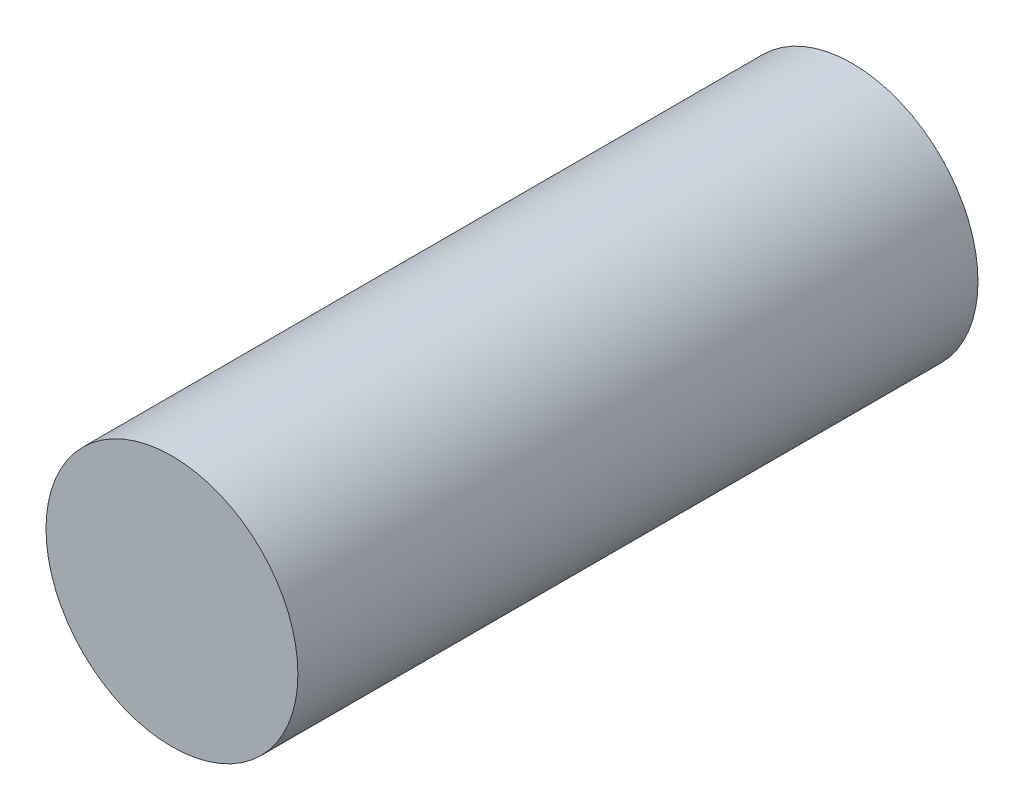
ISO-10303-21;
HEADER;
FILE_DESCRIPTION(('STEP AP214'),'2;1');
FILE_NAME('part.step','',(''),(''),'','','');
FILE_SCHEMA(('AUTOMOTIVE_DESIGN { 1 0 10303 214 1 1 1 1 }'));
ENDSEC;
DATA;
#1=APPLICATION_CONTEXT('core data for automotive mechanical design processes');
#2=APPLICATION_PROTOCOL_DEFINITION('international standard','automotive_design',2000,#1);
#3=PRODUCT_CONTEXT('',#1,'mechanical');
#4=PRODUCT('Part','Part','',(#3));
#5=PRODUCT_RELATED_PRODUCT_CATEGORY('part','',(#4));
#6=PRODUCT_DEFINITION_FORMATION('','',#4);
#7=PRODUCT_DEFINITION_CONTEXT('part definition',#1,'design');
#8=PRODUCT_DEFINITION('design','',#6,#7);
#9=PRODUCT_DEFINITION_SHAPE('','',#8);
#10=(LENGTH_UNIT() NAMED_UNIT(*) SI_UNIT(.MILLI.,.METRE.));
#11=(NAMED_UNIT(*) PLANE_ANGLE_UNIT() SI_UNIT($,.RADIAN.));
#12=(NAMED_UNIT(*) SI_UNIT($,.STERADIAN.) SOLID_ANGLE_UNIT());
#13=UNCERTAINTY_MEASURE_WITH_UNIT(LENGTH_MEASURE(1.E-05),#10,'distance_accuracy_value','');
#14=(GEOMETRIC_REPRESENTATION_CONTEXT(3) GLOBAL_UNCERTAINTY_ASSIGNED_CONTEXT((#13)) GLOBAL_UNIT_ASSIGNED_CONTEXT((#10,
#11,#12)) REPRESENTATION_CONTEXT('',''));
#15=CARTESIAN_POINT('',(0.,0.,0.));
#16=DIRECTION('',(0.,0.,1.));
#17=DIRECTION('',(1.,0.,0.));
#18=AXIS2_PLACEMENT_3D('',#15,#16,#17);
#19=CARTESIAN_POINT('',(0.,0.,34.29));
#20=DIRECTION('',(0.,0.,-1.));
#21=DIRECTION('',(-1.,0.,0.));
#22=AXIS2_PLACEMENT_3D('',#19,#20,#21);
#23=CYLINDRICAL_SURFACE('',#22,6.35);
#24=CARTESIAN_POINT('',(0.,0.,34.29));
#25=DIRECTION('',(0.,0.,1.));
#26=DIRECTION('',(1.,0.,0.));
#27=AXIS2_PLACEMENT_3D('',#24,#25,#26);
#28=CIRCLE('',#27,6.35);
#29=CARTESIAN_POINT('',(6.35,0.,34.29));
#30=VERTEX_POINT('',#29);
#31=EDGE_CURVE('E10',#30,#30,#28,.T.);
#32=ORIENTED_EDGE('',*,*,#31,.F.);
#33=EDGE_LOOP('',(#32));
#34=FACE_BOUND('',#33,.T.);
#35=CARTESIAN_POINT('',(0.,0.,0.));
#36=DIRECTION('',(0.,0.,1.));
#37=DIRECTION('',(1.,0.,0.));
#38=AXIS2_PLACEMENT_3D('',#35,#36,#37);
#39=CIRCLE('',#38,6.35);
#40=CARTESIAN_POINT('',(6.35,0.,0.));
#41=VERTEX_POINT('',#40);
#42=EDGE_CURVE('E40',#41,#41,#39,.T.);
#43=ORIENTED_EDGE('',*,*,#42,.T.);
#44=EDGE_LOOP('',(#43));
#45=FACE_BOUND('',#44,.T.);
#46=ADVANCED_FACE('F37',(#34,#45),#23,.T.);
#47=CARTESIAN_POINT('',(0.,0.,34.29));
#48=DIRECTION('',(0.,0.,1.));
#49=DIRECTION('',(1.,0.,0.));
#50=AXIS2_PLACEMENT_3D('',#47,#48,#49);
#51=PLANE('',#50);
#52=ORIENTED_EDGE('',*,*,#31,.T.);
#53=EDGE_LOOP('',(#52));
#54=FACE_BOUND('',#53,.T.);
#55=ADVANCED_FACE('F54',(#54),#51,.T.);
#56=CARTESIAN_POINT('',(0.,0.,0.));
#57=DIRECTION('',(0.,0.,1.));
#58=DIRECTION('',(1.,0.,0.));
#59=AXIS2_PLACEMENT_3D('',#56,#57,#58);
#60=PLANE('',#59);
#61=ORIENTED_EDGE('',*,*,#42,.F.);
#62=EDGE_LOOP('',(#61));
#63=FACE_BOUND('',#62,.T.);
#64=ADVANCED_FACE('F52',(#63),#60,.F.);
#65=CLOSED_SHELL('',(#46,#55,#64));
#66=MANIFOLD_SOLID_BREP('B2',#65);
#67=ADVANCED_BREP_SHAPE_REPRESENTATION('',(#18,#66),#14);
#68=SHAPE_DEFINITION_REPRESENTATION(#9,#67);
ENDSEC;
END-ISO-10303-21;
